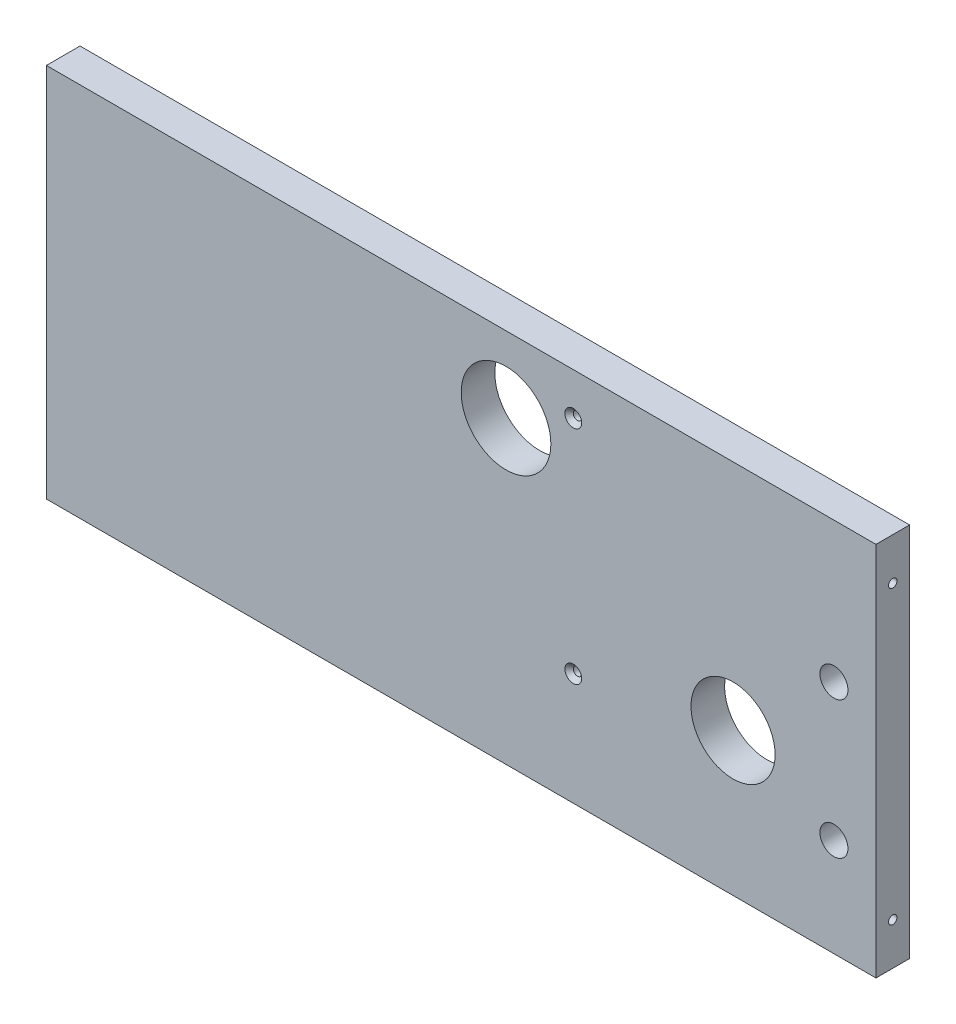
ISO-10303-21;
HEADER;
FILE_DESCRIPTION(('STEP AP214'),'2;1');
FILE_NAME('part.step','',(''),(''),'','','');
FILE_SCHEMA(('AUTOMOTIVE_DESIGN { 1 0 10303 214 1 1 1 1 }'));
ENDSEC;
DATA;
#1=APPLICATION_CONTEXT('core data for automotive mechanical design processes');
#2=APPLICATION_PROTOCOL_DEFINITION('international standard','automotive_design',2000,#1);
#3=PRODUCT_CONTEXT('',#1,'mechanical');
#4=PRODUCT('Part','Part','',(#3));
#5=PRODUCT_RELATED_PRODUCT_CATEGORY('part','',(#4));
#6=PRODUCT_DEFINITION_FORMATION('','',#4);
#7=PRODUCT_DEFINITION_CONTEXT('part definition',#1,'design');
#8=PRODUCT_DEFINITION('design','',#6,#7);
#9=PRODUCT_DEFINITION_SHAPE('','',#8);
#10=(LENGTH_UNIT() NAMED_UNIT(*) SI_UNIT(.MILLI.,.METRE.));
#11=(NAMED_UNIT(*) PLANE_ANGLE_UNIT() SI_UNIT($,.RADIAN.));
#12=(NAMED_UNIT(*) SI_UNIT($,.STERADIAN.) SOLID_ANGLE_UNIT());
#13=UNCERTAINTY_MEASURE_WITH_UNIT(LENGTH_MEASURE(1.E-05),#10,'distance_accuracy_value','');
#14=(GEOMETRIC_REPRESENTATION_CONTEXT(3) GLOBAL_UNCERTAINTY_ASSIGNED_CONTEXT((#13)) GLOBAL_UNIT_ASSIGNED_CONTEXT((#10,
#11,#12)) REPRESENTATION_CONTEXT('',''));
#15=CARTESIAN_POINT('',(0.,0.,0.));
#16=DIRECTION('',(0.,0.,1.));
#17=DIRECTION('',(1.,0.,0.));
#18=AXIS2_PLACEMENT_3D('',#15,#16,#17);
#19=CARTESIAN_POINT('',(200.189127439861,40.,12.));
#20=DIRECTION('',(0.,0.,-1.));
#21=DIRECTION('',(-1.,0.,0.));
#22=AXIS2_PLACEMENT_3D('',#19,#20,#21);
#23=CYLINDRICAL_SURFACE('',#22,1.5);
#24=CARTESIAN_POINT('',(200.189127439861,40.,0.));
#25=DIRECTION('',(0.,0.,1.));
#26=DIRECTION('',(1.,0.,0.));
#27=AXIS2_PLACEMENT_3D('',#24,#25,#26);
#28=CIRCLE('',#27,1.5);
#29=CARTESIAN_POINT('',(201.689127439861,40.,0.));
#30=VERTEX_POINT('',#29);
#31=EDGE_CURVE('E151',#30,#30,#28,.T.);
#32=ORIENTED_EDGE('',*,*,#31,.F.);
#33=EDGE_LOOP('',(#32));
#34=FACE_BOUND('',#33,.T.);
#35=CARTESIAN_POINT('',(200.189127439861,40.,10.5));
#36=DIRECTION('',(0.,0.,1.));
#37=DIRECTION('',(1.,0.,0.));
#38=AXIS2_PLACEMENT_3D('',#35,#36,#37);
#39=CIRCLE('',#38,1.5);
#40=CARTESIAN_POINT('',(201.689127439861,40.,10.5));
#41=VERTEX_POINT('',#40);
#42=EDGE_CURVE('E37',#41,#41,#39,.T.);
#43=ORIENTED_EDGE('',*,*,#42,.T.);
#44=EDGE_LOOP('',(#43));
#45=FACE_BOUND('',#44,.T.);
#46=ADVANCED_FACE('F33',(#34,#45),#23,.F.);
#47=CARTESIAN_POINT('',(200.189127439861,119.,12.));
#48=DIRECTION('',(0.,0.,-1.));
#49=DIRECTION('',(-1.,0.,0.));
#50=AXIS2_PLACEMENT_3D('',#47,#48,#49);
#51=CYLINDRICAL_SURFACE('',#50,1.5);
#52=CARTESIAN_POINT('',(200.189127439861,119.,0.));
#53=DIRECTION('',(0.,0.,1.));
#54=DIRECTION('',(1.,0.,0.));
#55=AXIS2_PLACEMENT_3D('',#52,#53,#54);
#56=CIRCLE('',#55,1.5);
#57=CARTESIAN_POINT('',(201.689127439861,119.,0.));
#58=VERTEX_POINT('',#57);
#59=EDGE_CURVE('E104',#58,#58,#56,.T.);
#60=ORIENTED_EDGE('',*,*,#59,.F.);
#61=EDGE_LOOP('',(#60));
#62=FACE_BOUND('',#61,.T.);
#63=CARTESIAN_POINT('',(200.189127439861,119.,10.5));
#64=DIRECTION('',(0.,0.,1.));
#65=DIRECTION('',(1.,0.,0.));
#66=AXIS2_PLACEMENT_3D('',#63,#64,#65);
#67=CIRCLE('',#66,1.5);
#68=CARTESIAN_POINT('',(201.689127439861,119.,10.5));
#69=VERTEX_POINT('',#68);
#70=EDGE_CURVE('E109',#69,#69,#67,.T.);
#71=ORIENTED_EDGE('',*,*,#70,.T.);
#72=EDGE_LOOP('',(#71));
#73=FACE_BOUND('',#72,.T.);
#74=ADVANCED_FACE('F180',(#62,#73),#51,.F.);
#75=CARTESIAN_POINT('',(0.,0.,12.));
#76=DIRECTION('',(0.,0.,-1.));
#77=DIRECTION('',(-1.,0.,0.));
#78=AXIS2_PLACEMENT_3D('',#75,#76,#77);
#79=PLANE('',#78);
#80=CARTESIAN_POINT('',(200.189127439861,40.,12.));
#81=DIRECTION('',(0.,0.,-1.));
#82=DIRECTION('',(-1.,0.,0.));
#83=AXIS2_PLACEMENT_3D('',#80,#81,#82);
#84=CIRCLE('',#83,2.99999999999999);
#85=CARTESIAN_POINT('',(197.189127439861,40.,12.));
#86=VERTEX_POINT('',#85);
#87=EDGE_CURVE('E123',#86,#86,#84,.T.);
#88=ORIENTED_EDGE('',*,*,#87,.T.);
#89=EDGE_LOOP('',(#88));
#90=FACE_BOUND('',#89,.T.);
#91=CARTESIAN_POINT('',(200.189127439861,119.,12.));
#92=DIRECTION('',(0.,0.,-1.));
#93=DIRECTION('',(-1.,0.,0.));
#94=AXIS2_PLACEMENT_3D('',#91,#92,#93);
#95=CIRCLE('',#94,2.99999999999999);
#96=CARTESIAN_POINT('',(197.189127439861,119.,12.));
#97=VERTEX_POINT('',#96);
#98=EDGE_CURVE('E112',#97,#97,#95,.T.);
#99=ORIENTED_EDGE('',*,*,#98,.T.);
#100=EDGE_LOOP('',(#99));
#101=FACE_BOUND('',#100,.T.);
#102=DIRECTION('',(0.,-1.,0.));
#103=VECTOR('',#102,1.);
#104=CARTESIAN_POINT('',(12.189127439861,0.,12.));
#105=LINE('',#104,#103);
#106=CARTESIAN_POINT('',(12.189127439861,134.,12.));
#107=VERTEX_POINT('',#106);
#108=CARTESIAN_POINT('',(12.189127439861,0.,12.));
#109=VERTEX_POINT('',#108);
#110=EDGE_CURVE('E88',#107,#109,#105,.T.);
#111=ORIENTED_EDGE('',*,*,#110,.T.);
#112=DIRECTION('',(1.,0.,0.));
#113=VECTOR('',#112,1.);
#114=CARTESIAN_POINT('',(12.189127439861,0.,12.));
#115=LINE('',#114,#113);
#116=CARTESIAN_POINT('',(308.189127439861,0.,12.));
#117=VERTEX_POINT('',#116);
#118=EDGE_CURVE('E82',#109,#117,#115,.T.);
#119=ORIENTED_EDGE('',*,*,#118,.T.);
#120=DIRECTION('',(0.,1.,0.));
#121=VECTOR('',#120,1.);
#122=CARTESIAN_POINT('',(308.189127439861,0.,12.));
#123=LINE('',#122,#121);
#124=CARTESIAN_POINT('',(308.189127439861,134.,12.));
#125=VERTEX_POINT('',#124);
#126=EDGE_CURVE('E86',#117,#125,#123,.T.);
#127=ORIENTED_EDGE('',*,*,#126,.T.);
#128=DIRECTION('',(-1.,0.,0.));
#129=VECTOR('',#128,1.);
#130=CARTESIAN_POINT('',(12.189127439861,134.,12.));
#131=LINE('',#130,#129);
#132=EDGE_CURVE('E52',#125,#107,#131,.T.);
#133=ORIENTED_EDGE('',*,*,#132,.T.);
#134=EDGE_LOOP('',(#111,#119,#127,#133));
#135=FACE_BOUND('',#134,.T.);
#136=CARTESIAN_POINT('',(293.189127439861,84.,12.));
#137=DIRECTION('',(0.,0.,1.));
#138=DIRECTION('',(1.,0.,0.));
#139=AXIS2_PLACEMENT_3D('',#136,#137,#138);
#140=CIRCLE('',#139,4.99999999999999);
#141=CARTESIAN_POINT('',(298.189127439861,84.,12.));
#142=VERTEX_POINT('',#141);
#143=EDGE_CURVE('E169',#142,#142,#140,.T.);
#144=ORIENTED_EDGE('',*,*,#143,.F.);
#145=EDGE_LOOP('',(#144));
#146=FACE_BOUND('',#145,.T.);
#147=CARTESIAN_POINT('',(293.189127439861,35.,12.));
#148=DIRECTION('',(0.,0.,1.));
#149=DIRECTION('',(1.,0.,0.));
#150=AXIS2_PLACEMENT_3D('',#147,#148,#149);
#151=CIRCLE('',#150,4.99999999999999);
#152=CARTESIAN_POINT('',(298.189127439861,35.,12.));
#153=VERTEX_POINT('',#152);
#154=EDGE_CURVE('E163',#153,#153,#151,.T.);
#155=ORIENTED_EDGE('',*,*,#154,.F.);
#156=EDGE_LOOP('',(#155));
#157=FACE_BOUND('',#156,.T.);
#158=CARTESIAN_POINT('',(257.189127439861,51.,12.));
#159=DIRECTION('',(0.,0.,1.));
#160=DIRECTION('',(1.,0.,0.));
#161=AXIS2_PLACEMENT_3D('',#158,#159,#160);
#162=CIRCLE('',#161,15.);
#163=CARTESIAN_POINT('',(272.189127439861,51.,12.));
#164=VERTEX_POINT('',#163);
#165=EDGE_CURVE('E157',#164,#164,#162,.T.);
#166=ORIENTED_EDGE('',*,*,#165,.F.);
#167=EDGE_LOOP('',(#166));
#168=FACE_BOUND('',#167,.T.);
#169=CARTESIAN_POINT('',(176.189127439861,107.,12.));
#170=DIRECTION('',(0.,0.,1.));
#171=DIRECTION('',(1.,0.,0.));
#172=AXIS2_PLACEMENT_3D('',#169,#170,#171);
#173=CIRCLE('',#172,16.);
#174=CARTESIAN_POINT('',(192.189127439861,107.,12.));
#175=VERTEX_POINT('',#174);
#176=EDGE_CURVE('E148',#175,#175,#173,.T.);
#177=ORIENTED_EDGE('',*,*,#176,.F.);
#178=EDGE_LOOP('',(#177));
#179=FACE_BOUND('',#178,.T.);
#180=ADVANCED_FACE('F83',(#90,#101,#135,#146,#157,#168,#179),#79,.F.);
#181=CARTESIAN_POINT('',(0.,0.,0.));
#182=DIRECTION('',(0.,0.,-1.));
#183=DIRECTION('',(-1.,0.,0.));
#184=AXIS2_PLACEMENT_3D('',#181,#182,#183);
#185=PLANE('',#184);
#186=CARTESIAN_POINT('',(255.189127439861,122.,0.));
#187=DIRECTION('',(0.,0.,-1.));
#188=DIRECTION('',(-1.,0.,0.));
#189=AXIS2_PLACEMENT_3D('',#186,#187,#188);
#190=CIRCLE('',#189,1.50000000000002);
#191=CARTESIAN_POINT('',(253.689127439861,122.,0.));
#192=VERTEX_POINT('',#191);
#193=EDGE_CURVE('E501',#192,#192,#190,.T.);
#194=ORIENTED_EDGE('',*,*,#193,.F.);
#195=EDGE_LOOP('',(#194));
#196=FACE_BOUND('',#195,.T.);
#197=CARTESIAN_POINT('',(221.189127439861,92.,0.));
#198=DIRECTION('',(0.,0.,-1.));
#199=DIRECTION('',(-1.,0.,0.));
#200=AXIS2_PLACEMENT_3D('',#197,#198,#199);
#201=CIRCLE('',#200,1.5);
#202=CARTESIAN_POINT('',(219.689127439861,92.,0.));
#203=VERTEX_POINT('',#202);
#204=EDGE_CURVE('E511',#203,#203,#201,.T.);
#205=ORIENTED_EDGE('',*,*,#204,.F.);
#206=EDGE_LOOP('',(#205));
#207=FACE_BOUND('',#206,.T.);
#208=CARTESIAN_POINT('',(255.189127439861,92.,0.));
#209=DIRECTION('',(0.,0.,-1.));
#210=DIRECTION('',(-1.,0.,0.));
#211=AXIS2_PLACEMENT_3D('',#208,#209,#210);
#212=CIRCLE('',#211,1.50000000000002);
#213=CARTESIAN_POINT('',(253.689127439861,92.,0.));
#214=VERTEX_POINT('',#213);
#215=EDGE_CURVE('E517',#214,#214,#212,.T.);
#216=ORIENTED_EDGE('',*,*,#215,.F.);
#217=EDGE_LOOP('',(#216));
#218=FACE_BOUND('',#217,.T.);
#219=CARTESIAN_POINT('',(221.189127439861,122.,0.));
#220=DIRECTION('',(0.,0.,-1.));
#221=DIRECTION('',(-1.,0.,0.));
#222=AXIS2_PLACEMENT_3D('',#219,#220,#221);
#223=CIRCLE('',#222,1.5);
#224=CARTESIAN_POINT('',(219.689127439861,122.,0.));
#225=VERTEX_POINT('',#224);
#226=EDGE_CURVE('E500',#225,#225,#223,.T.);
#227=ORIENTED_EDGE('',*,*,#226,.F.);
#228=EDGE_LOOP('',(#227));
#229=FACE_BOUND('',#228,.T.);
#230=ORIENTED_EDGE('',*,*,#31,.T.);
#231=EDGE_LOOP('',(#230));
#232=FACE_BOUND('',#231,.T.);
#233=CARTESIAN_POINT('',(293.189127439861,35.,0.));
#234=DIRECTION('',(0.,0.,1.));
#235=DIRECTION('',(1.,0.,0.));
#236=AXIS2_PLACEMENT_3D('',#233,#234,#235);
#237=CIRCLE('',#236,4.99999999999999);
#238=CARTESIAN_POINT('',(298.189127439861,35.,0.));
#239=VERTEX_POINT('',#238);
#240=EDGE_CURVE('E160',#239,#239,#237,.T.);
#241=ORIENTED_EDGE('',*,*,#240,.T.);
#242=EDGE_LOOP('',(#241));
#243=FACE_BOUND('',#242,.T.);
#244=ORIENTED_EDGE('',*,*,#59,.T.);
#245=EDGE_LOOP('',(#244));
#246=FACE_BOUND('',#245,.T.);
#247=DIRECTION('',(0.,-1.,0.));
#248=VECTOR('',#247,1.);
#249=CARTESIAN_POINT('',(12.189127439861,0.,0.));
#250=LINE('',#249,#248);
#251=CARTESIAN_POINT('',(12.189127439861,134.,0.));
#252=VERTEX_POINT('',#251);
#253=CARTESIAN_POINT('',(12.189127439861,0.,0.));
#254=VERTEX_POINT('',#253);
#255=EDGE_CURVE('E101',#252,#254,#250,.T.);
#256=ORIENTED_EDGE('',*,*,#255,.F.);
#257=DIRECTION('',(-1.,0.,0.));
#258=VECTOR('',#257,1.);
#259=CARTESIAN_POINT('',(12.189127439861,134.,0.));
#260=LINE('',#259,#258);
#261=CARTESIAN_POINT('',(308.189127439861,134.,0.));
#262=VERTEX_POINT('',#261);
#263=EDGE_CURVE('E75',#262,#252,#260,.T.);
#264=ORIENTED_EDGE('',*,*,#263,.F.);
#265=DIRECTION('',(0.,1.,0.));
#266=VECTOR('',#265,1.);
#267=CARTESIAN_POINT('',(308.189127439861,0.,0.));
#268=LINE('',#267,#266);
#269=CARTESIAN_POINT('',(308.189127439861,0.,0.));
#270=VERTEX_POINT('',#269);
#271=EDGE_CURVE('E69',#270,#262,#268,.T.);
#272=ORIENTED_EDGE('',*,*,#271,.F.);
#273=DIRECTION('',(1.,0.,0.));
#274=VECTOR('',#273,1.);
#275=CARTESIAN_POINT('',(12.189127439861,0.,0.));
#276=LINE('',#275,#274);
#277=EDGE_CURVE('E92',#254,#270,#276,.T.);
#278=ORIENTED_EDGE('',*,*,#277,.F.);
#279=EDGE_LOOP('',(#256,#264,#272,#278));
#280=FACE_BOUND('',#279,.T.);
#281=CARTESIAN_POINT('',(293.189127439861,84.,0.));
#282=DIRECTION('',(0.,0.,1.));
#283=DIRECTION('',(1.,0.,0.));
#284=AXIS2_PLACEMENT_3D('',#281,#282,#283);
#285=CIRCLE('',#284,4.99999999999999);
#286=CARTESIAN_POINT('',(298.189127439861,84.,0.));
#287=VERTEX_POINT('',#286);
#288=EDGE_CURVE('E166',#287,#287,#285,.T.);
#289=ORIENTED_EDGE('',*,*,#288,.T.);
#290=EDGE_LOOP('',(#289));
#291=FACE_BOUND('',#290,.T.);
#292=CARTESIAN_POINT('',(257.189127439861,51.,0.));
#293=DIRECTION('',(0.,0.,1.));
#294=DIRECTION('',(1.,0.,0.));
#295=AXIS2_PLACEMENT_3D('',#292,#293,#294);
#296=CIRCLE('',#295,15.);
#297=CARTESIAN_POINT('',(272.189127439861,51.,0.));
#298=VERTEX_POINT('',#297);
#299=EDGE_CURVE('E156',#298,#298,#296,.T.);
#300=ORIENTED_EDGE('',*,*,#299,.T.);
#301=EDGE_LOOP('',(#300));
#302=FACE_BOUND('',#301,.T.);
#303=CARTESIAN_POINT('',(176.189127439861,107.,0.));
#304=DIRECTION('',(0.,0.,1.));
#305=DIRECTION('',(1.,0.,0.));
#306=AXIS2_PLACEMENT_3D('',#303,#304,#305);
#307=CIRCLE('',#306,16.);
#308=CARTESIAN_POINT('',(192.189127439861,107.,0.));
#309=VERTEX_POINT('',#308);
#310=EDGE_CURVE('E145',#309,#309,#307,.T.);
#311=ORIENTED_EDGE('',*,*,#310,.T.);
#312=EDGE_LOOP('',(#311));
#313=FACE_BOUND('',#312,.T.);
#314=ADVANCED_FACE('F177',(#196,#207,#218,#229,#232,#243,#246,#280,#291,#302,#313),#185,.T.);
#315=CARTESIAN_POINT('',(12.189127439861,0.,12.));
#316=DIRECTION('',(1.,0.,0.));
#317=DIRECTION('',(0.,0.,-1.));
#318=AXIS2_PLACEMENT_3D('',#315,#316,#317);
#319=PLANE('',#318);
#320=CARTESIAN_POINT('',(12.189127439861,15.,6.));
#321=DIRECTION('',(1.,0.,0.));
#322=DIRECTION('',(0.,0.,-1.));
#323=AXIS2_PLACEMENT_3D('',#320,#321,#322);
#324=CIRCLE('',#323,1.5);
#325=CARTESIAN_POINT('',(12.189127439861,15.,4.5));
#326=VERTEX_POINT('',#325);
#327=EDGE_CURVE('E133',#326,#326,#324,.T.);
#328=ORIENTED_EDGE('',*,*,#327,.T.);
#329=EDGE_LOOP('',(#328));
#330=FACE_BOUND('',#329,.T.);
#331=CARTESIAN_POINT('',(12.189127439861,119.,6.00000000000002));
#332=DIRECTION('',(1.,0.,0.));
#333=DIRECTION('',(0.,0.,-1.));
#334=AXIS2_PLACEMENT_3D('',#331,#332,#333);
#335=CIRCLE('',#334,1.5);
#336=CARTESIAN_POINT('',(12.189127439861,119.,4.50000000000001));
#337=VERTEX_POINT('',#336);
#338=EDGE_CURVE('E139',#337,#337,#335,.T.);
#339=ORIENTED_EDGE('',*,*,#338,.T.);
#340=EDGE_LOOP('',(#339));
#341=FACE_BOUND('',#340,.T.);
#342=ORIENTED_EDGE('',*,*,#255,.T.);
#343=DIRECTION('',(0.,0.,-1.));
#344=VECTOR('',#343,1.);
#345=CARTESIAN_POINT('',(12.189127439861,0.,12.));
#346=LINE('',#345,#344);
#347=EDGE_CURVE('E11',#109,#254,#346,.T.);
#348=ORIENTED_EDGE('',*,*,#347,.F.);
#349=ORIENTED_EDGE('',*,*,#110,.F.);
#350=DIRECTION('',(0.,0.,-1.));
#351=VECTOR('',#350,1.);
#352=CARTESIAN_POINT('',(12.189127439861,134.,12.));
#353=LINE('',#352,#351);
#354=EDGE_CURVE('E97',#107,#252,#353,.T.);
#355=ORIENTED_EDGE('',*,*,#354,.T.);
#356=EDGE_LOOP('',(#342,#348,#349,#355));
#357=FACE_BOUND('',#356,.T.);
#358=ADVANCED_FACE('F35',(#330,#341,#357),#319,.F.);
#359=CARTESIAN_POINT('',(12.189127439861,0.,12.));
#360=DIRECTION('',(0.,1.,0.));
#361=DIRECTION('',(0.,0.,1.));
#362=AXIS2_PLACEMENT_3D('',#359,#360,#361);
#363=PLANE('',#362);
#364=ORIENTED_EDGE('',*,*,#277,.T.);
#365=DIRECTION('',(0.,0.,-1.));
#366=VECTOR('',#365,1.);
#367=CARTESIAN_POINT('',(308.189127439861,0.,12.));
#368=LINE('',#367,#366);
#369=EDGE_CURVE('E43',#117,#270,#368,.T.);
#370=ORIENTED_EDGE('',*,*,#369,.F.);
#371=ORIENTED_EDGE('',*,*,#118,.F.);
#372=ORIENTED_EDGE('',*,*,#347,.T.);
#373=EDGE_LOOP('',(#364,#370,#371,#372));
#374=FACE_BOUND('',#373,.T.);
#375=ADVANCED_FACE('F91',(#374),#363,.F.);
#376=CARTESIAN_POINT('',(308.189127439861,0.,12.));
#377=DIRECTION('',(-1.,0.,0.));
#378=DIRECTION('',(0.,-1.,0.));
#379=AXIS2_PLACEMENT_3D('',#376,#377,#378);
#380=PLANE('',#379);
#381=CARTESIAN_POINT('',(308.189127439861,15.,6.));
#382=DIRECTION('',(-1.,0.,0.));
#383=DIRECTION('',(0.,-1.,0.));
#384=AXIS2_PLACEMENT_3D('',#381,#382,#383);
#385=CIRCLE('',#384,1.5);
#386=CARTESIAN_POINT('',(308.189127439861,13.5,6.));
#387=VERTEX_POINT('',#386);
#388=EDGE_CURVE('E111',#387,#387,#385,.T.);
#389=ORIENTED_EDGE('',*,*,#388,.T.);
#390=EDGE_LOOP('',(#389));
#391=FACE_BOUND('',#390,.T.);
#392=CARTESIAN_POINT('',(308.189127439861,119.,6.00000000000002));
#393=DIRECTION('',(-1.,0.,0.));
#394=DIRECTION('',(0.,-1.,0.));
#395=AXIS2_PLACEMENT_3D('',#392,#393,#394);
#396=CIRCLE('',#395,1.5);
#397=CARTESIAN_POINT('',(308.189127439861,117.5,6.00000000000002));
#398=VERTEX_POINT('',#397);
#399=EDGE_CURVE('E128',#398,#398,#396,.T.);
#400=ORIENTED_EDGE('',*,*,#399,.T.);
#401=EDGE_LOOP('',(#400));
#402=FACE_BOUND('',#401,.T.);
#403=ORIENTED_EDGE('',*,*,#271,.T.);
#404=DIRECTION('',(0.,0.,-1.));
#405=VECTOR('',#404,1.);
#406=CARTESIAN_POINT('',(308.189127439861,134.,12.));
#407=LINE('',#406,#405);
#408=EDGE_CURVE('E93',#125,#262,#407,.T.);
#409=ORIENTED_EDGE('',*,*,#408,.F.);
#410=ORIENTED_EDGE('',*,*,#126,.F.);
#411=ORIENTED_EDGE('',*,*,#369,.T.);
#412=EDGE_LOOP('',(#403,#409,#410,#411));
#413=FACE_BOUND('',#412,.T.);
#414=ADVANCED_FACE('F95',(#391,#402,#413),#380,.F.);
#415=CARTESIAN_POINT('',(12.189127439861,134.,12.));
#416=DIRECTION('',(0.,-1.,0.));
#417=DIRECTION('',(0.,0.,-1.));
#418=AXIS2_PLACEMENT_3D('',#415,#416,#417);
#419=PLANE('',#418);
#420=ORIENTED_EDGE('',*,*,#263,.T.);
#421=ORIENTED_EDGE('',*,*,#354,.F.);
#422=ORIENTED_EDGE('',*,*,#132,.F.);
#423=ORIENTED_EDGE('',*,*,#408,.T.);
#424=EDGE_LOOP('',(#420,#421,#422,#423));
#425=FACE_BOUND('',#424,.T.);
#426=ADVANCED_FACE('F198',(#425),#419,.F.);
#427=CARTESIAN_POINT('',(293.189127439861,84.,12.));
#428=DIRECTION('',(0.,0.,-1.));
#429=DIRECTION('',(-1.,0.,0.));
#430=AXIS2_PLACEMENT_3D('',#427,#428,#429);
#431=CYLINDRICAL_SURFACE('',#430,4.99999999999999);
#432=ORIENTED_EDGE('',*,*,#143,.T.);
#433=EDGE_LOOP('',(#432));
#434=FACE_BOUND('',#433,.T.);
#435=ORIENTED_EDGE('',*,*,#288,.F.);
#436=EDGE_LOOP('',(#435));
#437=FACE_BOUND('',#436,.T.);
#438=ADVANCED_FACE('F192',(#434,#437),#431,.F.);
#439=CARTESIAN_POINT('',(293.189127439861,35.,12.));
#440=DIRECTION('',(0.,0.,-1.));
#441=DIRECTION('',(-1.,0.,0.));
#442=AXIS2_PLACEMENT_3D('',#439,#440,#441);
#443=CYLINDRICAL_SURFACE('',#442,4.99999999999999);
#444=ORIENTED_EDGE('',*,*,#154,.T.);
#445=EDGE_LOOP('',(#444));
#446=FACE_BOUND('',#445,.T.);
#447=ORIENTED_EDGE('',*,*,#240,.F.);
#448=EDGE_LOOP('',(#447));
#449=FACE_BOUND('',#448,.T.);
#450=ADVANCED_FACE('F235',(#446,#449),#443,.F.);
#451=CARTESIAN_POINT('',(257.189127439861,51.,12.));
#452=DIRECTION('',(0.,0.,-1.));
#453=DIRECTION('',(-1.,0.,0.));
#454=AXIS2_PLACEMENT_3D('',#451,#452,#453);
#455=CYLINDRICAL_SURFACE('',#454,15.);
#456=ORIENTED_EDGE('',*,*,#165,.T.);
#457=EDGE_LOOP('',(#456));
#458=FACE_BOUND('',#457,.T.);
#459=ORIENTED_EDGE('',*,*,#299,.F.);
#460=EDGE_LOOP('',(#459));
#461=FACE_BOUND('',#460,.T.);
#462=ADVANCED_FACE('F225',(#458,#461),#455,.F.);
#463=CARTESIAN_POINT('',(176.189127439861,107.,12.));
#464=DIRECTION('',(0.,0.,-1.));
#465=DIRECTION('',(-1.,0.,0.));
#466=AXIS2_PLACEMENT_3D('',#463,#464,#465);
#467=CYLINDRICAL_SURFACE('',#466,16.);
#468=ORIENTED_EDGE('',*,*,#176,.T.);
#469=EDGE_LOOP('',(#468));
#470=FACE_BOUND('',#469,.T.);
#471=ORIENTED_EDGE('',*,*,#310,.F.);
#472=EDGE_LOOP('',(#471));
#473=FACE_BOUND('',#472,.T.);
#474=ADVANCED_FACE('F222',(#470,#473),#467,.F.);
#475=CARTESIAN_POINT('',(32.189127439861,119.,6.00000000000002));
#476=DIRECTION('',(-1.,0.,0.));
#477=DIRECTION('',(0.,0.,1.));
#478=AXIS2_PLACEMENT_3D('',#475,#476,#477);
#479=CYLINDRICAL_SURFACE('',#478,1.5);
#480=CARTESIAN_POINT('',(32.189127439861,119.,6.00000000000002));
#481=DIRECTION('',(1.,0.,0.));
#482=DIRECTION('',(0.,0.,-1.));
#483=AXIS2_PLACEMENT_3D('',#480,#481,#482);
#484=CIRCLE('',#483,1.5);
#485=CARTESIAN_POINT('',(32.189127439861,119.,4.50000000000001));
#486=VERTEX_POINT('',#485);
#487=EDGE_CURVE('E142',#486,#486,#484,.T.);
#488=ORIENTED_EDGE('',*,*,#487,.T.);
#489=EDGE_LOOP('',(#488));
#490=FACE_BOUND('',#489,.T.);
#491=ORIENTED_EDGE('',*,*,#338,.F.);
#492=EDGE_LOOP('',(#491));
#493=FACE_BOUND('',#492,.T.);
#494=ADVANCED_FACE('F224',(#490,#493),#479,.F.);
#495=CARTESIAN_POINT('',(32.189127439861,119.,6.00000000000002));
#496=DIRECTION('',(1.,0.,0.));
#497=DIRECTION('',(0.,0.,-1.));
#498=AXIS2_PLACEMENT_3D('',#495,#496,#497);
#499=PLANE('',#498);
#500=ORIENTED_EDGE('',*,*,#487,.F.);
#501=EDGE_LOOP('',(#500));
#502=FACE_BOUND('',#501,.T.);
#503=ADVANCED_FACE('F232',(#502),#499,.F.);
#504=CARTESIAN_POINT('',(32.189127439861,15.,6.));
#505=DIRECTION('',(-1.,0.,0.));
#506=DIRECTION('',(0.,0.,1.));
#507=AXIS2_PLACEMENT_3D('',#504,#505,#506);
#508=CYLINDRICAL_SURFACE('',#507,1.5);
#509=CARTESIAN_POINT('',(32.189127439861,15.,6.));
#510=DIRECTION('',(1.,0.,0.));
#511=DIRECTION('',(0.,0.,-1.));
#512=AXIS2_PLACEMENT_3D('',#509,#510,#511);
#513=CIRCLE('',#512,1.5);
#514=CARTESIAN_POINT('',(32.189127439861,15.,4.5));
#515=VERTEX_POINT('',#514);
#516=EDGE_CURVE('E136',#515,#515,#513,.T.);
#517=ORIENTED_EDGE('',*,*,#516,.T.);
#518=EDGE_LOOP('',(#517));
#519=FACE_BOUND('',#518,.T.);
#520=ORIENTED_EDGE('',*,*,#327,.F.);
#521=EDGE_LOOP('',(#520));
#522=FACE_BOUND('',#521,.T.);
#523=ADVANCED_FACE('F444',(#519,#522),#508,.F.);
#524=CARTESIAN_POINT('',(32.189127439861,15.,6.));
#525=DIRECTION('',(1.,0.,0.));
#526=DIRECTION('',(0.,0.,-1.));
#527=AXIS2_PLACEMENT_3D('',#524,#525,#526);
#528=PLANE('',#527);
#529=ORIENTED_EDGE('',*,*,#516,.F.);
#530=EDGE_LOOP('',(#529));
#531=FACE_BOUND('',#530,.T.);
#532=ADVANCED_FACE('F274',(#531),#528,.F.);
#533=CARTESIAN_POINT('',(288.189127439861,119.,6.00000000000002));
#534=DIRECTION('',(1.,0.,0.));
#535=DIRECTION('',(0.,0.,-1.));
#536=AXIS2_PLACEMENT_3D('',#533,#534,#535);
#537=CYLINDRICAL_SURFACE('',#536,1.5);
#538=CARTESIAN_POINT('',(288.189127439861,119.,6.00000000000002));
#539=DIRECTION('',(-1.,0.,0.));
#540=DIRECTION('',(0.,-1.,0.));
#541=AXIS2_PLACEMENT_3D('',#538,#539,#540);
#542=CIRCLE('',#541,1.5);
#543=CARTESIAN_POINT('',(288.189127439861,117.5,6.00000000000002));
#544=VERTEX_POINT('',#543);
#545=EDGE_CURVE('E130',#544,#544,#542,.T.);
#546=ORIENTED_EDGE('',*,*,#545,.T.);
#547=EDGE_LOOP('',(#546));
#548=FACE_BOUND('',#547,.T.);
#549=ORIENTED_EDGE('',*,*,#399,.F.);
#550=EDGE_LOOP('',(#549));
#551=FACE_BOUND('',#550,.T.);
#552=ADVANCED_FACE('F279',(#548,#551),#537,.F.);
#553=CARTESIAN_POINT('',(288.189127439861,119.,6.00000000000002));
#554=DIRECTION('',(-1.,0.,0.));
#555=DIRECTION('',(0.,-1.,0.));
#556=AXIS2_PLACEMENT_3D('',#553,#554,#555);
#557=PLANE('',#556);
#558=ORIENTED_EDGE('',*,*,#545,.F.);
#559=EDGE_LOOP('',(#558));
#560=FACE_BOUND('',#559,.T.);
#561=ADVANCED_FACE('F284',(#560),#557,.F.);
#562=CARTESIAN_POINT('',(288.189127439861,15.,6.));
#563=DIRECTION('',(1.,0.,0.));
#564=DIRECTION('',(0.,0.,-1.));
#565=AXIS2_PLACEMENT_3D('',#562,#563,#564);
#566=CYLINDRICAL_SURFACE('',#565,1.5);
#567=CARTESIAN_POINT('',(288.189127439861,15.,6.));
#568=DIRECTION('',(-1.,0.,0.));
#569=DIRECTION('',(0.,-1.,0.));
#570=AXIS2_PLACEMENT_3D('',#567,#568,#569);
#571=CIRCLE('',#570,1.5);
#572=CARTESIAN_POINT('',(288.189127439861,13.5,6.));
#573=VERTEX_POINT('',#572);
#574=EDGE_CURVE('E116',#573,#573,#571,.T.);
#575=ORIENTED_EDGE('',*,*,#574,.T.);
#576=EDGE_LOOP('',(#575));
#577=FACE_BOUND('',#576,.T.);
#578=ORIENTED_EDGE('',*,*,#388,.F.);
#579=EDGE_LOOP('',(#578));
#580=FACE_BOUND('',#579,.T.);
#581=ADVANCED_FACE('F294',(#577,#580),#566,.F.);
#582=CARTESIAN_POINT('',(288.189127439861,15.,6.));
#583=DIRECTION('',(-1.,0.,0.));
#584=DIRECTION('',(0.,-1.,0.));
#585=AXIS2_PLACEMENT_3D('',#582,#583,#584);
#586=PLANE('',#585);
#587=ORIENTED_EDGE('',*,*,#574,.F.);
#588=EDGE_LOOP('',(#587));
#589=FACE_BOUND('',#588,.T.);
#590=ADVANCED_FACE('F304',(#589),#586,.F.);
#591=CARTESIAN_POINT('',(200.189127439861,119.,12.));
#592=DIRECTION('',(0.,0.,1.));
#593=DIRECTION('',(-1.,0.,0.));
#594=AXIS2_PLACEMENT_3D('',#591,#592,#593);
#595=CONICAL_SURFACE('',#594,2.99999999999999,0.78539816339745);
#596=ORIENTED_EDGE('',*,*,#70,.F.);
#597=EDGE_LOOP('',(#596));
#598=FACE_BOUND('',#597,.T.);
#599=ORIENTED_EDGE('',*,*,#98,.F.);
#600=EDGE_LOOP('',(#599));
#601=FACE_BOUND('',#600,.T.);
#602=ADVANCED_FACE('F314',(#598,#601),#595,.F.);
#603=CARTESIAN_POINT('',(200.189127439861,40.,12.));
#604=DIRECTION('',(0.,0.,1.));
#605=DIRECTION('',(-1.,0.,0.));
#606=AXIS2_PLACEMENT_3D('',#603,#604,#605);
#607=CONICAL_SURFACE('',#606,2.99999999999999,0.78539816339745);
#608=ORIENTED_EDGE('',*,*,#42,.F.);
#609=EDGE_LOOP('',(#608));
#610=FACE_BOUND('',#609,.T.);
#611=ORIENTED_EDGE('',*,*,#87,.F.);
#612=EDGE_LOOP('',(#611));
#613=FACE_BOUND('',#612,.T.);
#614=ADVANCED_FACE('F341',(#610,#613),#607,.F.);
#615=CARTESIAN_POINT('',(221.189127439861,122.,10.));
#616=DIRECTION('',(0.,0.,-1.));
#617=DIRECTION('',(-1.,0.,0.));
#618=AXIS2_PLACEMENT_3D('',#615,#616,#617);
#619=CYLINDRICAL_SURFACE('',#618,1.5);
#620=CARTESIAN_POINT('',(221.189127439861,122.,10.));
#621=DIRECTION('',(0.,0.,-1.));
#622=DIRECTION('',(-1.,0.,0.));
#623=AXIS2_PLACEMENT_3D('',#620,#621,#622);
#624=CIRCLE('',#623,1.5);
#625=CARTESIAN_POINT('',(219.689127439861,122.,10.));
#626=VERTEX_POINT('',#625);
#627=EDGE_CURVE('E504',#626,#626,#624,.T.);
#628=ORIENTED_EDGE('',*,*,#627,.F.);
#629=EDGE_LOOP('',(#628));
#630=FACE_BOUND('',#629,.T.);
#631=ORIENTED_EDGE('',*,*,#226,.T.);
#632=EDGE_LOOP('',(#631));
#633=FACE_BOUND('',#632,.T.);
#634=ADVANCED_FACE('F351',(#630,#633),#619,.F.);
#635=CARTESIAN_POINT('',(221.189127439861,122.,10.));
#636=DIRECTION('',(0.,0.,-1.));
#637=DIRECTION('',(-1.,0.,0.));
#638=AXIS2_PLACEMENT_3D('',#635,#636,#637);
#639=PLANE('',#638);
#640=ORIENTED_EDGE('',*,*,#627,.T.);
#641=EDGE_LOOP('',(#640));
#642=FACE_BOUND('',#641,.T.);
#643=ADVANCED_FACE('F367',(#642),#639,.T.);
#644=CARTESIAN_POINT('',(255.189127439861,92.,10.));
#645=DIRECTION('',(0.,0.,-1.));
#646=DIRECTION('',(-1.,0.,0.));
#647=AXIS2_PLACEMENT_3D('',#644,#645,#646);
#648=CYLINDRICAL_SURFACE('',#647,1.50000000000002);
#649=CARTESIAN_POINT('',(255.189127439861,92.,10.));
#650=DIRECTION('',(0.,0.,-1.));
#651=DIRECTION('',(-1.,0.,0.));
#652=AXIS2_PLACEMENT_3D('',#649,#650,#651);
#653=CIRCLE('',#652,1.50000000000002);
#654=CARTESIAN_POINT('',(253.689127439861,92.,10.));
#655=VERTEX_POINT('',#654);
#656=EDGE_CURVE('E514',#655,#655,#653,.T.);
#657=ORIENTED_EDGE('',*,*,#656,.F.);
#658=EDGE_LOOP('',(#657));
#659=FACE_BOUND('',#658,.T.);
#660=ORIENTED_EDGE('',*,*,#215,.T.);
#661=EDGE_LOOP('',(#660));
#662=FACE_BOUND('',#661,.T.);
#663=ADVANCED_FACE('F377',(#659,#662),#648,.F.);
#664=CARTESIAN_POINT('',(255.189127439861,92.,10.));
#665=DIRECTION('',(0.,0.,-1.));
#666=DIRECTION('',(-1.,0.,0.));
#667=AXIS2_PLACEMENT_3D('',#664,#665,#666);
#668=PLANE('',#667);
#669=ORIENTED_EDGE('',*,*,#656,.T.);
#670=EDGE_LOOP('',(#669));
#671=FACE_BOUND('',#670,.T.);
#672=ADVANCED_FACE('F387',(#671),#668,.T.);
#673=CARTESIAN_POINT('',(221.189127439861,92.,10.));
#674=DIRECTION('',(0.,0.,-1.));
#675=DIRECTION('',(-1.,0.,0.));
#676=AXIS2_PLACEMENT_3D('',#673,#674,#675);
#677=CYLINDRICAL_SURFACE('',#676,1.5);
#678=CARTESIAN_POINT('',(221.189127439861,92.,10.));
#679=DIRECTION('',(0.,0.,-1.));
#680=DIRECTION('',(-1.,0.,0.));
#681=AXIS2_PLACEMENT_3D('',#678,#679,#680);
#682=CIRCLE('',#681,1.5);
#683=CARTESIAN_POINT('',(219.689127439861,92.,10.));
#684=VERTEX_POINT('',#683);
#685=EDGE_CURVE('E506',#684,#684,#682,.T.);
#686=ORIENTED_EDGE('',*,*,#685,.F.);
#687=EDGE_LOOP('',(#686));
#688=FACE_BOUND('',#687,.T.);
#689=ORIENTED_EDGE('',*,*,#204,.T.);
#690=EDGE_LOOP('',(#689));
#691=FACE_BOUND('',#690,.T.);
#692=ADVANCED_FACE('F397',(#688,#691),#677,.F.);
#693=CARTESIAN_POINT('',(221.189127439861,92.,10.));
#694=DIRECTION('',(0.,0.,-1.));
#695=DIRECTION('',(-1.,0.,0.));
#696=AXIS2_PLACEMENT_3D('',#693,#694,#695);
#697=PLANE('',#696);
#698=ORIENTED_EDGE('',*,*,#685,.T.);
#699=EDGE_LOOP('',(#698));
#700=FACE_BOUND('',#699,.T.);
#701=ADVANCED_FACE('F407',(#700),#697,.T.);
#702=CARTESIAN_POINT('',(255.189127439861,122.,10.));
#703=DIRECTION('',(0.,0.,-1.));
#704=DIRECTION('',(-1.,0.,0.));
#705=AXIS2_PLACEMENT_3D('',#702,#703,#704);
#706=CYLINDRICAL_SURFACE('',#705,1.50000000000002);
#707=CARTESIAN_POINT('',(255.189127439861,122.,10.));
#708=DIRECTION('',(0.,0.,-1.));
#709=DIRECTION('',(-1.,0.,0.));
#710=AXIS2_PLACEMENT_3D('',#707,#708,#709);
#711=CIRCLE('',#710,1.50000000000002);
#712=CARTESIAN_POINT('',(253.689127439861,122.,10.));
#713=VERTEX_POINT('',#712);
#714=EDGE_CURVE('E499',#713,#713,#711,.T.);
#715=ORIENTED_EDGE('',*,*,#714,.F.);
#716=EDGE_LOOP('',(#715));
#717=FACE_BOUND('',#716,.T.);
#718=ORIENTED_EDGE('',*,*,#193,.T.);
#719=EDGE_LOOP('',(#718));
#720=FACE_BOUND('',#719,.T.);
#721=ADVANCED_FACE('F417',(#717,#720),#706,.F.);
#722=CARTESIAN_POINT('',(255.189127439861,122.,10.));
#723=DIRECTION('',(0.,0.,-1.));
#724=DIRECTION('',(-1.,0.,0.));
#725=AXIS2_PLACEMENT_3D('',#722,#723,#724);
#726=PLANE('',#725);
#727=ORIENTED_EDGE('',*,*,#714,.T.);
#728=EDGE_LOOP('',(#727));
#729=FACE_BOUND('',#728,.T.);
#730=ADVANCED_FACE('F427',(#729),#726,.T.);
#731=CLOSED_SHELL('',(#46,#74,#180,#314,#358,#375,#414,#426,#438,#450,#462,#474,#494,#503,#523,
#532,#552,#561,#581,#590,#602,#614,#634,#643,#663,#672,#692,#701,#721,#730));
#732=MANIFOLD_SOLID_BREP('B2',#731);
#733=ADVANCED_BREP_SHAPE_REPRESENTATION('',(#18,#732),#14);
#734=SHAPE_DEFINITION_REPRESENTATION(#9,#733);
ENDSEC;
END-ISO-10303-21;
